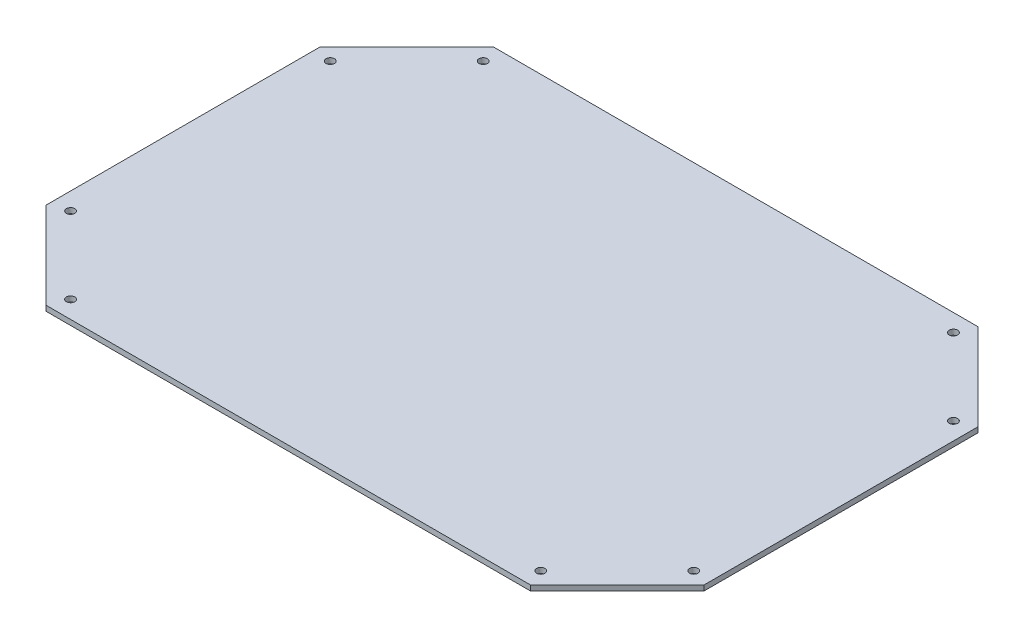
ISO-10303-21;
HEADER;
FILE_DESCRIPTION(('STEP AP214'),'2;1');
FILE_NAME('part.step','',(''),(''),'','','');
FILE_SCHEMA(('AUTOMOTIVE_DESIGN { 1 0 10303 214 1 1 1 1 }'));
ENDSEC;
DATA;
#1=APPLICATION_CONTEXT('core data for automotive mechanical design processes');
#2=APPLICATION_PROTOCOL_DEFINITION('international standard','automotive_design',2000,#1);
#3=PRODUCT_CONTEXT('',#1,'mechanical');
#4=PRODUCT('Part','Part','',(#3));
#5=PRODUCT_RELATED_PRODUCT_CATEGORY('part','',(#4));
#6=PRODUCT_DEFINITION_FORMATION('','',#4);
#7=PRODUCT_DEFINITION_CONTEXT('part definition',#1,'design');
#8=PRODUCT_DEFINITION('design','',#6,#7);
#9=PRODUCT_DEFINITION_SHAPE('','',#8);
#10=(LENGTH_UNIT() NAMED_UNIT(*) SI_UNIT(.MILLI.,.METRE.));
#11=(NAMED_UNIT(*) PLANE_ANGLE_UNIT() SI_UNIT($,.RADIAN.));
#12=(NAMED_UNIT(*) SI_UNIT($,.STERADIAN.) SOLID_ANGLE_UNIT());
#13=UNCERTAINTY_MEASURE_WITH_UNIT(LENGTH_MEASURE(1.E-05),#10,'distance_accuracy_value','');
#14=(GEOMETRIC_REPRESENTATION_CONTEXT(3) GLOBAL_UNCERTAINTY_ASSIGNED_CONTEXT((#13)) GLOBAL_UNIT_ASSIGNED_CONTEXT((#10,
#11,#12)) REPRESENTATION_CONTEXT('',''));
#15=CARTESIAN_POINT('',(0.,0.,0.));
#16=DIRECTION('',(0.,0.,1.));
#17=DIRECTION('',(1.,0.,0.));
#18=AXIS2_PLACEMENT_3D('',#15,#16,#17);
#19=CARTESIAN_POINT('',(0.,2.,0.));
#20=DIRECTION('',(0.,1.,0.));
#21=DIRECTION('',(0.,0.,1.));
#22=AXIS2_PLACEMENT_3D('',#19,#20,#21);
#23=PLANE('',#22);
#24=CARTESIAN_POINT('',(118.4,2.,49.3372583002031));
#25=DIRECTION('',(0.,1.,0.));
#26=DIRECTION('',(0.,0.,1.));
#27=AXIS2_PLACEMENT_3D('',#24,#25,#26);
#28=CIRCLE('',#27,1.60000000000001);
#29=CARTESIAN_POINT('',(118.4,2.,50.9372583002031));
#30=VERTEX_POINT('',#29);
#31=EDGE_CURVE('E224',#30,#30,#28,.T.);
#32=ORIENTED_EDGE('',*,*,#31,.F.);
#33=EDGE_LOOP('',(#32));
#34=FACE_BOUND('',#33,.T.);
#35=CARTESIAN_POINT('',(89.3372583002031,2.,-78.4));
#36=DIRECTION('',(0.,1.,0.));
#37=DIRECTION('',(0.,0.,1.));
#38=AXIS2_PLACEMENT_3D('',#35,#36,#37);
#39=CIRCLE('',#38,1.60000000000001);
#40=CARTESIAN_POINT('',(89.3372583002031,2.,-76.8));
#41=VERTEX_POINT('',#40);
#42=EDGE_CURVE('E212',#41,#41,#39,.T.);
#43=ORIENTED_EDGE('',*,*,#42,.F.);
#44=EDGE_LOOP('',(#43));
#45=FACE_BOUND('',#44,.T.);
#46=CARTESIAN_POINT('',(-118.4,2.,-49.337258300203));
#47=DIRECTION('',(0.,1.,0.));
#48=DIRECTION('',(0.,0.,1.));
#49=AXIS2_PLACEMENT_3D('',#46,#47,#48);
#50=CIRCLE('',#49,1.60000000000001);
#51=CARTESIAN_POINT('',(-118.4,2.,-47.737258300203));
#52=VERTEX_POINT('',#51);
#53=EDGE_CURVE('E200',#52,#52,#50,.T.);
#54=ORIENTED_EDGE('',*,*,#53,.F.);
#55=EDGE_LOOP('',(#54));
#56=FACE_BOUND('',#55,.T.);
#57=CARTESIAN_POINT('',(-89.337258300203,2.,78.4));
#58=DIRECTION('',(0.,1.,0.));
#59=DIRECTION('',(0.,0.,1.));
#60=AXIS2_PLACEMENT_3D('',#57,#58,#59);
#61=CIRCLE('',#60,1.60000000000001);
#62=CARTESIAN_POINT('',(-89.337258300203,2.,80.));
#63=VERTEX_POINT('',#62);
#64=EDGE_CURVE('E146',#63,#63,#61,.T.);
#65=ORIENTED_EDGE('',*,*,#64,.F.);
#66=EDGE_LOOP('',(#65));
#67=FACE_BOUND('',#66,.T.);
#68=DIRECTION('',(0.,0.,-1.));
#69=VECTOR('',#68,1.);
#70=CARTESIAN_POINT('',(125.,2.,52.0710678118655));
#71=LINE('',#70,#69);
#72=CARTESIAN_POINT('',(125.,2.,52.0710678118655));
#73=VERTEX_POINT('',#72);
#74=CARTESIAN_POINT('',(125.,2.,-52.0710678118655));
#75=VERTEX_POINT('',#74);
#76=EDGE_CURVE('E157',#73,#75,#71,.T.);
#77=ORIENTED_EDGE('',*,*,#76,.T.);
#78=DIRECTION('',(-0.707106781186549,0.,-0.707106781186546));
#79=VECTOR('',#78,1.);
#80=CARTESIAN_POINT('',(125.,2.,-52.0710678118655));
#81=LINE('',#80,#79);
#82=CARTESIAN_POINT('',(92.0710678118655,2.,-85.));
#83=VERTEX_POINT('',#82);
#84=EDGE_CURVE('E105',#75,#83,#81,.T.);
#85=ORIENTED_EDGE('',*,*,#84,.T.);
#86=DIRECTION('',(-1.,0.,0.));
#87=VECTOR('',#86,1.);
#88=CARTESIAN_POINT('',(92.0710678118655,2.,-85.));
#89=LINE('',#88,#87);
#90=CARTESIAN_POINT('',(-92.0710678118654,2.,-85.));
#91=VERTEX_POINT('',#90);
#92=EDGE_CURVE('E172',#83,#91,#89,.T.);
#93=ORIENTED_EDGE('',*,*,#92,.T.);
#94=DIRECTION('',(-0.707106781186549,0.,0.707106781186546));
#95=VECTOR('',#94,1.);
#96=CARTESIAN_POINT('',(-92.0710678118654,2.,-85.));
#97=LINE('',#96,#95);
#98=CARTESIAN_POINT('',(-125.,2.,-52.0710678118655));
#99=VERTEX_POINT('',#98);
#100=EDGE_CURVE('E185',#91,#99,#97,.T.);
#101=ORIENTED_EDGE('',*,*,#100,.T.);
#102=DIRECTION('',(0.,0.,1.));
#103=VECTOR('',#102,1.);
#104=CARTESIAN_POINT('',(-125.,2.,-52.0710678118655));
#105=LINE('',#104,#103);
#106=CARTESIAN_POINT('',(-125.,2.,52.0710678118656));
#107=VERTEX_POINT('',#106);
#108=EDGE_CURVE('E124',#99,#107,#105,.T.);
#109=ORIENTED_EDGE('',*,*,#108,.T.);
#110=DIRECTION('',(0.70710678118655,0.,0.707106781186546));
#111=VECTOR('',#110,1.);
#112=CARTESIAN_POINT('',(-125.,2.,52.0710678118656));
#113=LINE('',#112,#111);
#114=CARTESIAN_POINT('',(-92.0710678118655,2.,85.));
#115=VERTEX_POINT('',#114);
#116=EDGE_CURVE('E118',#107,#115,#113,.T.);
#117=ORIENTED_EDGE('',*,*,#116,.T.);
#118=DIRECTION('',(1.,0.,0.));
#119=VECTOR('',#118,1.);
#120=CARTESIAN_POINT('',(-92.0710678118655,2.,85.));
#121=LINE('',#120,#119);
#122=CARTESIAN_POINT('',(92.0710678118655,2.,85.));
#123=VERTEX_POINT('',#122);
#124=EDGE_CURVE('E122',#115,#123,#121,.T.);
#125=ORIENTED_EDGE('',*,*,#124,.T.);
#126=DIRECTION('',(0.707106781186548,0.,-0.707106781186547));
#127=VECTOR('',#126,1.);
#128=CARTESIAN_POINT('',(92.0710678118655,2.,85.));
#129=LINE('',#128,#127);
#130=EDGE_CURVE('E62',#123,#73,#129,.T.);
#131=ORIENTED_EDGE('',*,*,#130,.T.);
#132=EDGE_LOOP('',(#77,#85,#93,#101,#109,#117,#125,#131));
#133=FACE_BOUND('',#132,.T.);
#134=CARTESIAN_POINT('',(-118.4,2.,49.3372583002031));
#135=DIRECTION('',(0.,1.,0.));
#136=DIRECTION('',(0.,0.,1.));
#137=AXIS2_PLACEMENT_3D('',#134,#135,#136);
#138=CIRCLE('',#137,1.60000000000001);
#139=CARTESIAN_POINT('',(-118.4,2.,50.9372583002031));
#140=VERTEX_POINT('',#139);
#141=EDGE_CURVE('E194',#140,#140,#138,.T.);
#142=ORIENTED_EDGE('',*,*,#141,.F.);
#143=EDGE_LOOP('',(#142));
#144=FACE_BOUND('',#143,.T.);
#145=CARTESIAN_POINT('',(-89.3372583002031,2.,-78.3999999999999));
#146=DIRECTION('',(0.,1.,0.));
#147=DIRECTION('',(0.,0.,1.));
#148=AXIS2_PLACEMENT_3D('',#145,#146,#147);
#149=CIRCLE('',#148,1.60000000000001);
#150=CARTESIAN_POINT('',(-89.3372583002031,2.,-76.8));
#151=VERTEX_POINT('',#150);
#152=EDGE_CURVE('E206',#151,#151,#149,.T.);
#153=ORIENTED_EDGE('',*,*,#152,.F.);
#154=EDGE_LOOP('',(#153));
#155=FACE_BOUND('',#154,.T.);
#156=CARTESIAN_POINT('',(118.4,2.,-49.3372583002031));
#157=DIRECTION('',(0.,1.,0.));
#158=DIRECTION('',(0.,0.,1.));
#159=AXIS2_PLACEMENT_3D('',#156,#157,#158);
#160=CIRCLE('',#159,1.60000000000001);
#161=CARTESIAN_POINT('',(118.4,2.,-47.7372583002031));
#162=VERTEX_POINT('',#161);
#163=EDGE_CURVE('E218',#162,#162,#160,.T.);
#164=ORIENTED_EDGE('',*,*,#163,.F.);
#165=EDGE_LOOP('',(#164));
#166=FACE_BOUND('',#165,.T.);
#167=CARTESIAN_POINT('',(89.3372583002031,2.,78.4));
#168=DIRECTION('',(0.,1.,0.));
#169=DIRECTION('',(0.,0.,1.));
#170=AXIS2_PLACEMENT_3D('',#167,#168,#169);
#171=CIRCLE('',#170,1.60000000000001);
#172=CARTESIAN_POINT('',(89.3372583002031,2.,80.));
#173=VERTEX_POINT('',#172);
#174=EDGE_CURVE('E230',#173,#173,#171,.T.);
#175=ORIENTED_EDGE('',*,*,#174,.F.);
#176=EDGE_LOOP('',(#175));
#177=FACE_BOUND('',#176,.T.);
#178=ADVANCED_FACE('F45',(#34,#45,#56,#67,#133,#144,#155,#166,#177),#23,.T.);
#179=CARTESIAN_POINT('',(0.,0.,0.));
#180=DIRECTION('',(0.,1.,0.));
#181=DIRECTION('',(0.,0.,1.));
#182=AXIS2_PLACEMENT_3D('',#179,#180,#181);
#183=PLANE('',#182);
#184=DIRECTION('',(0.,0.,-1.));
#185=VECTOR('',#184,1.);
#186=CARTESIAN_POINT('',(125.,0.,52.0710678118655));
#187=LINE('',#186,#185);
#188=CARTESIAN_POINT('',(125.,0.,52.0710678118655));
#189=VERTEX_POINT('',#188);
#190=CARTESIAN_POINT('',(125.,0.,-52.0710678118655));
#191=VERTEX_POINT('',#190);
#192=EDGE_CURVE('E142',#189,#191,#187,.T.);
#193=ORIENTED_EDGE('',*,*,#192,.F.);
#194=DIRECTION('',(0.707106781186548,0.,-0.707106781186547));
#195=VECTOR('',#194,1.);
#196=CARTESIAN_POINT('',(92.0710678118655,0.,85.));
#197=LINE('',#196,#195);
#198=CARTESIAN_POINT('',(92.0710678118655,0.,85.));
#199=VERTEX_POINT('',#198);
#200=EDGE_CURVE('E97',#199,#189,#197,.T.);
#201=ORIENTED_EDGE('',*,*,#200,.F.);
#202=DIRECTION('',(1.,0.,0.));
#203=VECTOR('',#202,1.);
#204=CARTESIAN_POINT('',(-92.0710678118655,0.,85.));
#205=LINE('',#204,#203);
#206=CARTESIAN_POINT('',(-92.0710678118655,0.,85.));
#207=VERTEX_POINT('',#206);
#208=EDGE_CURVE('E91',#207,#199,#205,.T.);
#209=ORIENTED_EDGE('',*,*,#208,.F.);
#210=DIRECTION('',(0.70710678118655,0.,0.707106781186546));
#211=VECTOR('',#210,1.);
#212=CARTESIAN_POINT('',(-125.,0.,52.0710678118656));
#213=LINE('',#212,#211);
#214=CARTESIAN_POINT('',(-125.,0.,52.0710678118656));
#215=VERTEX_POINT('',#214);
#216=EDGE_CURVE('E132',#215,#207,#213,.T.);
#217=ORIENTED_EDGE('',*,*,#216,.F.);
#218=DIRECTION('',(0.,0.,1.));
#219=VECTOR('',#218,1.);
#220=CARTESIAN_POINT('',(-125.,0.,-52.0710678118655));
#221=LINE('',#220,#219);
#222=CARTESIAN_POINT('',(-125.,0.,-52.0710678118655));
#223=VERTEX_POINT('',#222);
#224=EDGE_CURVE('E152',#223,#215,#221,.T.);
#225=ORIENTED_EDGE('',*,*,#224,.F.);
#226=DIRECTION('',(-0.707106781186549,0.,0.707106781186546));
#227=VECTOR('',#226,1.);
#228=CARTESIAN_POINT('',(-92.0710678118654,0.,-85.));
#229=LINE('',#228,#227);
#230=CARTESIAN_POINT('',(-92.0710678118654,0.,-85.));
#231=VERTEX_POINT('',#230);
#232=EDGE_CURVE('E150',#231,#223,#229,.T.);
#233=ORIENTED_EDGE('',*,*,#232,.F.);
#234=DIRECTION('',(-1.,0.,0.));
#235=VECTOR('',#234,1.);
#236=CARTESIAN_POINT('',(92.0710678118655,0.,-85.));
#237=LINE('',#236,#235);
#238=CARTESIAN_POINT('',(92.0710678118655,0.,-85.));
#239=VERTEX_POINT('',#238);
#240=EDGE_CURVE('E148',#239,#231,#237,.T.);
#241=ORIENTED_EDGE('',*,*,#240,.F.);
#242=DIRECTION('',(-0.707106781186549,0.,-0.707106781186546));
#243=VECTOR('',#242,1.);
#244=CARTESIAN_POINT('',(125.,0.,-52.0710678118655));
#245=LINE('',#244,#243);
#246=EDGE_CURVE('E145',#191,#239,#245,.T.);
#247=ORIENTED_EDGE('',*,*,#246,.F.);
#248=EDGE_LOOP('',(#193,#201,#209,#217,#225,#233,#241,#247));
#249=FACE_BOUND('',#248,.T.);
#250=CARTESIAN_POINT('',(-89.337258300203,0.,78.4));
#251=DIRECTION('',(0.,1.,0.));
#252=DIRECTION('',(0.,0.,1.));
#253=AXIS2_PLACEMENT_3D('',#250,#251,#252);
#254=CIRCLE('',#253,1.60000000000001);
#255=CARTESIAN_POINT('',(-89.337258300203,0.,80.));
#256=VERTEX_POINT('',#255);
#257=EDGE_CURVE('E191',#256,#256,#254,.T.);
#258=ORIENTED_EDGE('',*,*,#257,.T.);
#259=EDGE_LOOP('',(#258));
#260=FACE_BOUND('',#259,.T.);
#261=CARTESIAN_POINT('',(-118.4,0.,49.3372583002031));
#262=DIRECTION('',(0.,1.,0.));
#263=DIRECTION('',(0.,0.,1.));
#264=AXIS2_PLACEMENT_3D('',#261,#262,#263);
#265=CIRCLE('',#264,1.60000000000001);
#266=CARTESIAN_POINT('',(-118.4,0.,50.9372583002031));
#267=VERTEX_POINT('',#266);
#268=EDGE_CURVE('E197',#267,#267,#265,.T.);
#269=ORIENTED_EDGE('',*,*,#268,.T.);
#270=EDGE_LOOP('',(#269));
#271=FACE_BOUND('',#270,.T.);
#272=CARTESIAN_POINT('',(-118.4,0.,-49.337258300203));
#273=DIRECTION('',(0.,1.,0.));
#274=DIRECTION('',(0.,0.,1.));
#275=AXIS2_PLACEMENT_3D('',#272,#273,#274);
#276=CIRCLE('',#275,1.60000000000001);
#277=CARTESIAN_POINT('',(-118.4,0.,-47.737258300203));
#278=VERTEX_POINT('',#277);
#279=EDGE_CURVE('E203',#278,#278,#276,.T.);
#280=ORIENTED_EDGE('',*,*,#279,.T.);
#281=EDGE_LOOP('',(#280));
#282=FACE_BOUND('',#281,.T.);
#283=CARTESIAN_POINT('',(-89.3372583002031,0.,-78.3999999999999));
#284=DIRECTION('',(0.,1.,0.));
#285=DIRECTION('',(0.,0.,1.));
#286=AXIS2_PLACEMENT_3D('',#283,#284,#285);
#287=CIRCLE('',#286,1.60000000000001);
#288=CARTESIAN_POINT('',(-89.3372583002031,0.,-76.8));
#289=VERTEX_POINT('',#288);
#290=EDGE_CURVE('E209',#289,#289,#287,.T.);
#291=ORIENTED_EDGE('',*,*,#290,.T.);
#292=EDGE_LOOP('',(#291));
#293=FACE_BOUND('',#292,.T.);
#294=CARTESIAN_POINT('',(89.3372583002031,0.,-78.4));
#295=DIRECTION('',(0.,1.,0.));
#296=DIRECTION('',(0.,0.,1.));
#297=AXIS2_PLACEMENT_3D('',#294,#295,#296);
#298=CIRCLE('',#297,1.60000000000001);
#299=CARTESIAN_POINT('',(89.3372583002031,0.,-76.8));
#300=VERTEX_POINT('',#299);
#301=EDGE_CURVE('E215',#300,#300,#298,.T.);
#302=ORIENTED_EDGE('',*,*,#301,.T.);
#303=EDGE_LOOP('',(#302));
#304=FACE_BOUND('',#303,.T.);
#305=CARTESIAN_POINT('',(118.4,0.,-49.3372583002031));
#306=DIRECTION('',(0.,1.,0.));
#307=DIRECTION('',(0.,0.,1.));
#308=AXIS2_PLACEMENT_3D('',#305,#306,#307);
#309=CIRCLE('',#308,1.60000000000001);
#310=CARTESIAN_POINT('',(118.4,0.,-47.7372583002031));
#311=VERTEX_POINT('',#310);
#312=EDGE_CURVE('E221',#311,#311,#309,.T.);
#313=ORIENTED_EDGE('',*,*,#312,.T.);
#314=EDGE_LOOP('',(#313));
#315=FACE_BOUND('',#314,.T.);
#316=CARTESIAN_POINT('',(118.4,0.,49.3372583002031));
#317=DIRECTION('',(0.,1.,0.));
#318=DIRECTION('',(0.,0.,1.));
#319=AXIS2_PLACEMENT_3D('',#316,#317,#318);
#320=CIRCLE('',#319,1.60000000000001);
#321=CARTESIAN_POINT('',(118.4,0.,50.9372583002031));
#322=VERTEX_POINT('',#321);
#323=EDGE_CURVE('E227',#322,#322,#320,.T.);
#324=ORIENTED_EDGE('',*,*,#323,.T.);
#325=EDGE_LOOP('',(#324));
#326=FACE_BOUND('',#325,.T.);
#327=CARTESIAN_POINT('',(89.3372583002031,0.,78.4));
#328=DIRECTION('',(0.,1.,0.));
#329=DIRECTION('',(0.,0.,1.));
#330=AXIS2_PLACEMENT_3D('',#327,#328,#329);
#331=CIRCLE('',#330,1.60000000000001);
#332=CARTESIAN_POINT('',(89.3372583002031,0.,80.));
#333=VERTEX_POINT('',#332);
#334=EDGE_CURVE('E233',#333,#333,#331,.T.);
#335=ORIENTED_EDGE('',*,*,#334,.T.);
#336=EDGE_LOOP('',(#335));
#337=FACE_BOUND('',#336,.T.);
#338=ADVANCED_FACE('F176',(#249,#260,#271,#282,#293,#304,#315,#326,#337),#183,.F.);
#339=CARTESIAN_POINT('',(125.,2.,52.0710678118655));
#340=DIRECTION('',(-1.,0.,0.));
#341=DIRECTION('',(0.,0.,1.));
#342=AXIS2_PLACEMENT_3D('',#339,#340,#341);
#343=PLANE('',#342);
#344=ORIENTED_EDGE('',*,*,#192,.T.);
#345=DIRECTION('',(0.,-1.,0.));
#346=VECTOR('',#345,1.);
#347=CARTESIAN_POINT('',(125.,2.,-52.0710678118655));
#348=LINE('',#347,#346);
#349=EDGE_CURVE('E11',#75,#191,#348,.T.);
#350=ORIENTED_EDGE('',*,*,#349,.F.);
#351=ORIENTED_EDGE('',*,*,#76,.F.);
#352=DIRECTION('',(0.,-1.,0.));
#353=VECTOR('',#352,1.);
#354=CARTESIAN_POINT('',(125.,2.,52.0710678118655));
#355=LINE('',#354,#353);
#356=EDGE_CURVE('E138',#73,#189,#355,.T.);
#357=ORIENTED_EDGE('',*,*,#356,.T.);
#358=EDGE_LOOP('',(#344,#350,#351,#357));
#359=FACE_BOUND('',#358,.T.);
#360=ADVANCED_FACE('F47',(#359),#343,.F.);
#361=CARTESIAN_POINT('',(125.,2.,-52.0710678118655));
#362=DIRECTION('',(-0.707106781186546,0.,0.707106781186549));
#363=DIRECTION('',(0.707106781186549,0.,0.707106781186546));
#364=AXIS2_PLACEMENT_3D('',#361,#362,#363);
#365=PLANE('',#364);
#366=ORIENTED_EDGE('',*,*,#246,.T.);
#367=DIRECTION('',(0.,-1.,0.));
#368=VECTOR('',#367,1.);
#369=CARTESIAN_POINT('',(92.0710678118655,2.,-85.));
#370=LINE('',#369,#368);
#371=EDGE_CURVE('E54',#83,#239,#370,.T.);
#372=ORIENTED_EDGE('',*,*,#371,.F.);
#373=ORIENTED_EDGE('',*,*,#84,.F.);
#374=ORIENTED_EDGE('',*,*,#349,.T.);
#375=EDGE_LOOP('',(#366,#372,#373,#374));
#376=FACE_BOUND('',#375,.T.);
#377=ADVANCED_FACE('F267',(#376),#365,.F.);
#378=CARTESIAN_POINT('',(92.0710678118655,2.,-85.));
#379=DIRECTION('',(0.,0.,1.));
#380=DIRECTION('',(1.,0.,0.));
#381=AXIS2_PLACEMENT_3D('',#378,#379,#380);
#382=PLANE('',#381);
#383=ORIENTED_EDGE('',*,*,#240,.T.);
#384=DIRECTION('',(0.,-1.,0.));
#385=VECTOR('',#384,1.);
#386=CARTESIAN_POINT('',(-92.0710678118654,2.,-85.));
#387=LINE('',#386,#385);
#388=EDGE_CURVE('E164',#91,#231,#387,.T.);
#389=ORIENTED_EDGE('',*,*,#388,.F.);
#390=ORIENTED_EDGE('',*,*,#92,.F.);
#391=ORIENTED_EDGE('',*,*,#371,.T.);
#392=EDGE_LOOP('',(#383,#389,#390,#391));
#393=FACE_BOUND('',#392,.T.);
#394=ADVANCED_FACE('F170',(#393),#382,.F.);
#395=CARTESIAN_POINT('',(-92.0710678118654,2.,-85.));
#396=DIRECTION('',(0.707106781186546,0.,0.707106781186549));
#397=DIRECTION('',(0.707106781186549,0.,-0.707106781186546));
#398=AXIS2_PLACEMENT_3D('',#395,#396,#397);
#399=PLANE('',#398);
#400=ORIENTED_EDGE('',*,*,#232,.T.);
#401=DIRECTION('',(0.,-1.,0.));
#402=VECTOR('',#401,1.);
#403=CARTESIAN_POINT('',(-125.,2.,-52.0710678118655));
#404=LINE('',#403,#402);
#405=EDGE_CURVE('E161',#99,#223,#404,.T.);
#406=ORIENTED_EDGE('',*,*,#405,.F.);
#407=ORIENTED_EDGE('',*,*,#100,.F.);
#408=ORIENTED_EDGE('',*,*,#388,.T.);
#409=EDGE_LOOP('',(#400,#406,#407,#408));
#410=FACE_BOUND('',#409,.T.);
#411=ADVANCED_FACE('F181',(#410),#399,.F.);
#412=CARTESIAN_POINT('',(-125.,2.,-52.0710678118655));
#413=DIRECTION('',(1.,0.,0.));
#414=DIRECTION('',(0.,0.,-1.));
#415=AXIS2_PLACEMENT_3D('',#412,#413,#414);
#416=PLANE('',#415);
#417=ORIENTED_EDGE('',*,*,#224,.T.);
#418=DIRECTION('',(0.,-1.,0.));
#419=VECTOR('',#418,1.);
#420=CARTESIAN_POINT('',(-125.,2.,52.0710678118656));
#421=LINE('',#420,#419);
#422=EDGE_CURVE('E133',#107,#215,#421,.T.);
#423=ORIENTED_EDGE('',*,*,#422,.F.);
#424=ORIENTED_EDGE('',*,*,#108,.F.);
#425=ORIENTED_EDGE('',*,*,#405,.T.);
#426=EDGE_LOOP('',(#417,#423,#424,#425));
#427=FACE_BOUND('',#426,.T.);
#428=ADVANCED_FACE('F184',(#427),#416,.F.);
#429=CARTESIAN_POINT('',(-125.,2.,52.0710678118656));
#430=DIRECTION('',(0.707106781186545,0.,-0.70710678118655));
#431=DIRECTION('',(-0.70710678118655,0.,-0.707106781186545));
#432=AXIS2_PLACEMENT_3D('',#429,#430,#431);
#433=PLANE('',#432);
#434=ORIENTED_EDGE('',*,*,#216,.T.);
#435=DIRECTION('',(0.,-1.,0.));
#436=VECTOR('',#435,1.);
#437=CARTESIAN_POINT('',(-92.0710678118655,2.,85.));
#438=LINE('',#437,#436);
#439=EDGE_CURVE('E129',#115,#207,#438,.T.);
#440=ORIENTED_EDGE('',*,*,#439,.F.);
#441=ORIENTED_EDGE('',*,*,#116,.F.);
#442=ORIENTED_EDGE('',*,*,#422,.T.);
#443=EDGE_LOOP('',(#434,#440,#441,#442));
#444=FACE_BOUND('',#443,.T.);
#445=ADVANCED_FACE('F130',(#444),#433,.F.);
#446=CARTESIAN_POINT('',(-92.0710678118655,2.,85.));
#447=DIRECTION('',(0.,0.,-1.));
#448=DIRECTION('',(-1.,0.,0.));
#449=AXIS2_PLACEMENT_3D('',#446,#447,#448);
#450=PLANE('',#449);
#451=ORIENTED_EDGE('',*,*,#208,.T.);
#452=DIRECTION('',(0.,-1.,0.));
#453=VECTOR('',#452,1.);
#454=CARTESIAN_POINT('',(92.0710678118655,2.,85.));
#455=LINE('',#454,#453);
#456=EDGE_CURVE('E134',#123,#199,#455,.T.);
#457=ORIENTED_EDGE('',*,*,#456,.F.);
#458=ORIENTED_EDGE('',*,*,#124,.F.);
#459=ORIENTED_EDGE('',*,*,#439,.T.);
#460=EDGE_LOOP('',(#451,#457,#458,#459));
#461=FACE_BOUND('',#460,.T.);
#462=ADVANCED_FACE('F136',(#461),#450,.F.);
#463=CARTESIAN_POINT('',(92.0710678118655,2.,85.));
#464=DIRECTION('',(-0.707106781186547,0.,-0.707106781186548));
#465=DIRECTION('',(-0.707106781186548,0.,0.707106781186547));
#466=AXIS2_PLACEMENT_3D('',#463,#464,#465);
#467=PLANE('',#466);
#468=ORIENTED_EDGE('',*,*,#200,.T.);
#469=ORIENTED_EDGE('',*,*,#356,.F.);
#470=ORIENTED_EDGE('',*,*,#130,.F.);
#471=ORIENTED_EDGE('',*,*,#456,.T.);
#472=EDGE_LOOP('',(#468,#469,#470,#471));
#473=FACE_BOUND('',#472,.T.);
#474=ADVANCED_FACE('F255',(#473),#467,.F.);
#475=CARTESIAN_POINT('',(-89.337258300203,2.,78.4));
#476=DIRECTION('',(0.,-1.,0.));
#477=DIRECTION('',(0.,0.,-1.));
#478=AXIS2_PLACEMENT_3D('',#475,#476,#477);
#479=CYLINDRICAL_SURFACE('',#478,1.60000000000001);
#480=ORIENTED_EDGE('',*,*,#64,.T.);
#481=EDGE_LOOP('',(#480));
#482=FACE_BOUND('',#481,.T.);
#483=ORIENTED_EDGE('',*,*,#257,.F.);
#484=EDGE_LOOP('',(#483));
#485=FACE_BOUND('',#484,.T.);
#486=ADVANCED_FACE('F252',(#482,#485),#479,.F.);
#487=CARTESIAN_POINT('',(-118.4,2.,49.3372583002031));
#488=DIRECTION('',(0.,-1.,0.));
#489=DIRECTION('',(0.,0.,-1.));
#490=AXIS2_PLACEMENT_3D('',#487,#488,#489);
#491=CYLINDRICAL_SURFACE('',#490,1.60000000000001);
#492=ORIENTED_EDGE('',*,*,#141,.T.);
#493=EDGE_LOOP('',(#492));
#494=FACE_BOUND('',#493,.T.);
#495=ORIENTED_EDGE('',*,*,#268,.F.);
#496=EDGE_LOOP('',(#495));
#497=FACE_BOUND('',#496,.T.);
#498=ADVANCED_FACE('F330',(#494,#497),#491,.F.);
#499=CARTESIAN_POINT('',(-118.4,2.,-49.337258300203));
#500=DIRECTION('',(0.,-1.,0.));
#501=DIRECTION('',(0.,0.,-1.));
#502=AXIS2_PLACEMENT_3D('',#499,#500,#501);
#503=CYLINDRICAL_SURFACE('',#502,1.60000000000001);
#504=ORIENTED_EDGE('',*,*,#53,.T.);
#505=EDGE_LOOP('',(#504));
#506=FACE_BOUND('',#505,.T.);
#507=ORIENTED_EDGE('',*,*,#279,.F.);
#508=EDGE_LOOP('',(#507));
#509=FACE_BOUND('',#508,.T.);
#510=ADVANCED_FACE('F338',(#506,#509),#503,.F.);
#511=CARTESIAN_POINT('',(-89.3372583002031,2.,-78.3999999999999));
#512=DIRECTION('',(0.,-1.,0.));
#513=DIRECTION('',(0.,0.,-1.));
#514=AXIS2_PLACEMENT_3D('',#511,#512,#513);
#515=CYLINDRICAL_SURFACE('',#514,1.60000000000001);
#516=ORIENTED_EDGE('',*,*,#152,.T.);
#517=EDGE_LOOP('',(#516));
#518=FACE_BOUND('',#517,.T.);
#519=ORIENTED_EDGE('',*,*,#290,.F.);
#520=EDGE_LOOP('',(#519));
#521=FACE_BOUND('',#520,.T.);
#522=ADVANCED_FACE('F346',(#518,#521),#515,.F.);
#523=CARTESIAN_POINT('',(89.3372583002031,2.,-78.4));
#524=DIRECTION('',(0.,-1.,0.));
#525=DIRECTION('',(0.,0.,-1.));
#526=AXIS2_PLACEMENT_3D('',#523,#524,#525);
#527=CYLINDRICAL_SURFACE('',#526,1.60000000000001);
#528=ORIENTED_EDGE('',*,*,#42,.T.);
#529=EDGE_LOOP('',(#528));
#530=FACE_BOUND('',#529,.T.);
#531=ORIENTED_EDGE('',*,*,#301,.F.);
#532=EDGE_LOOP('',(#531));
#533=FACE_BOUND('',#532,.T.);
#534=ADVANCED_FACE('F355',(#530,#533),#527,.F.);
#535=CARTESIAN_POINT('',(118.4,2.,-49.3372583002031));
#536=DIRECTION('',(0.,-1.,0.));
#537=DIRECTION('',(0.,0.,-1.));
#538=AXIS2_PLACEMENT_3D('',#535,#536,#537);
#539=CYLINDRICAL_SURFACE('',#538,1.60000000000001);
#540=ORIENTED_EDGE('',*,*,#163,.T.);
#541=EDGE_LOOP('',(#540));
#542=FACE_BOUND('',#541,.T.);
#543=ORIENTED_EDGE('',*,*,#312,.F.);
#544=EDGE_LOOP('',(#543));
#545=FACE_BOUND('',#544,.T.);
#546=ADVANCED_FACE('F364',(#542,#545),#539,.F.);
#547=CARTESIAN_POINT('',(118.4,2.,49.3372583002031));
#548=DIRECTION('',(0.,-1.,0.));
#549=DIRECTION('',(0.,0.,-1.));
#550=AXIS2_PLACEMENT_3D('',#547,#548,#549);
#551=CYLINDRICAL_SURFACE('',#550,1.60000000000001);
#552=ORIENTED_EDGE('',*,*,#31,.T.);
#553=EDGE_LOOP('',(#552));
#554=FACE_BOUND('',#553,.T.);
#555=ORIENTED_EDGE('',*,*,#323,.F.);
#556=EDGE_LOOP('',(#555));
#557=FACE_BOUND('',#556,.T.);
#558=ADVANCED_FACE('F373',(#554,#557),#551,.F.);
#559=CARTESIAN_POINT('',(89.3372583002031,2.,78.4));
#560=DIRECTION('',(0.,-1.,0.));
#561=DIRECTION('',(0.,0.,-1.));
#562=AXIS2_PLACEMENT_3D('',#559,#560,#561);
#563=CYLINDRICAL_SURFACE('',#562,1.60000000000001);
#564=ORIENTED_EDGE('',*,*,#174,.T.);
#565=EDGE_LOOP('',(#564));
#566=FACE_BOUND('',#565,.T.);
#567=ORIENTED_EDGE('',*,*,#334,.F.);
#568=EDGE_LOOP('',(#567));
#569=FACE_BOUND('',#568,.T.);
#570=ADVANCED_FACE('F239',(#566,#569),#563,.F.);
#571=CLOSED_SHELL('',(#178,#338,#360,#377,#394,#411,#428,#445,#462,#474,#486,#498,#510,#522,
#534,#546,#558,#570));
#572=MANIFOLD_SOLID_BREP('B2',#571);
#573=ADVANCED_BREP_SHAPE_REPRESENTATION('',(#18,#572),#14);
#574=SHAPE_DEFINITION_REPRESENTATION(#9,#573);
ENDSEC;
END-ISO-10303-21;
